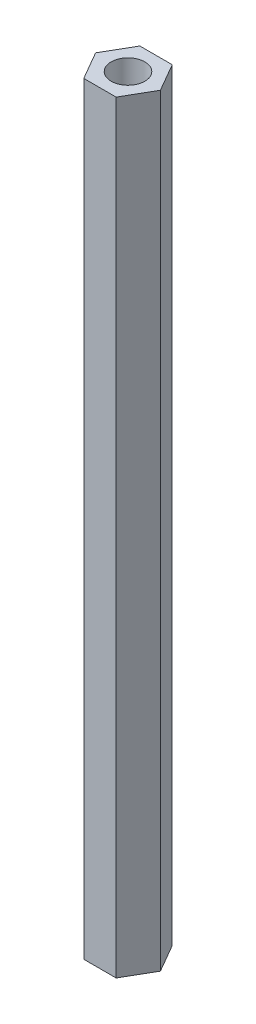
ISO-10303-21;
HEADER;
FILE_DESCRIPTION(('STEP AP214'),'2;1');
FILE_NAME('part.step','',(''),(''),'','','');
FILE_SCHEMA(('AUTOMOTIVE_DESIGN { 1 0 10303 214 1 1 1 1 }'));
ENDSEC;
DATA;
#1=APPLICATION_CONTEXT('core data for automotive mechanical design processes');
#2=APPLICATION_PROTOCOL_DEFINITION('international standard','automotive_design',2000,#1);
#3=PRODUCT_CONTEXT('',#1,'mechanical');
#4=PRODUCT('Part','Part','',(#3));
#5=PRODUCT_RELATED_PRODUCT_CATEGORY('part','',(#4));
#6=PRODUCT_DEFINITION_FORMATION('','',#4);
#7=PRODUCT_DEFINITION_CONTEXT('part definition',#1,'design');
#8=PRODUCT_DEFINITION('design','',#6,#7);
#9=PRODUCT_DEFINITION_SHAPE('','',#8);
#10=(LENGTH_UNIT() NAMED_UNIT(*) SI_UNIT(.MILLI.,.METRE.));
#11=(NAMED_UNIT(*) PLANE_ANGLE_UNIT() SI_UNIT($,.RADIAN.));
#12=(NAMED_UNIT(*) SI_UNIT($,.STERADIAN.) SOLID_ANGLE_UNIT());
#13=UNCERTAINTY_MEASURE_WITH_UNIT(LENGTH_MEASURE(1.E-05),#10,'distance_accuracy_value','');
#14=(GEOMETRIC_REPRESENTATION_CONTEXT(3) GLOBAL_UNCERTAINTY_ASSIGNED_CONTEXT((#13)) GLOBAL_UNIT_ASSIGNED_CONTEXT((#10,
#11,#12)) REPRESENTATION_CONTEXT('',''));
#15=CARTESIAN_POINT('',(0.,0.,0.));
#16=DIRECTION('',(0.,0.,1.));
#17=DIRECTION('',(1.,0.,0.));
#18=AXIS2_PLACEMENT_3D('',#15,#16,#17);
#19=CARTESIAN_POINT('',(1.44337567297407,68.,2.5));
#20=DIRECTION('',(-0.866025403784439,0.,-0.5));
#21=DIRECTION('',(-0.5,0.,0.866025403784439));
#22=AXIS2_PLACEMENT_3D('',#19,#20,#21);
#23=PLANE('',#22);
#24=DIRECTION('',(0.5,0.,-0.866025403784439));
#25=VECTOR('',#24,1.);
#26=CARTESIAN_POINT('',(1.44337567297407,0.,2.5));
#27=LINE('',#26,#25);
#28=CARTESIAN_POINT('',(1.44337567297407,0.,2.5));
#29=VERTEX_POINT('',#28);
#30=CARTESIAN_POINT('',(2.88675134594813,0.,0.));
#31=VERTEX_POINT('',#30);
#32=EDGE_CURVE('E117',#29,#31,#27,.T.);
#33=ORIENTED_EDGE('',*,*,#32,.T.);
#34=DIRECTION('',(0.,-1.,0.));
#35=VECTOR('',#34,1.);
#36=CARTESIAN_POINT('',(2.88675134594813,68.,0.));
#37=LINE('',#36,#35);
#38=CARTESIAN_POINT('',(2.88675134594813,68.,0.));
#39=VERTEX_POINT('',#38);
#40=EDGE_CURVE('E11',#39,#31,#37,.T.);
#41=ORIENTED_EDGE('',*,*,#40,.F.);
#42=DIRECTION('',(0.5,0.,-0.866025403784439));
#43=VECTOR('',#42,1.);
#44=CARTESIAN_POINT('',(1.44337567297407,68.,2.5));
#45=LINE('',#44,#43);
#46=CARTESIAN_POINT('',(1.44337567297407,68.,2.5));
#47=VERTEX_POINT('',#46);
#48=EDGE_CURVE('E128',#47,#39,#45,.T.);
#49=ORIENTED_EDGE('',*,*,#48,.F.);
#50=DIRECTION('',(0.,-1.,0.));
#51=VECTOR('',#50,1.);
#52=CARTESIAN_POINT('',(1.44337567297407,68.,2.5));
#53=LINE('',#52,#51);
#54=EDGE_CURVE('E113',#47,#29,#53,.T.);
#55=ORIENTED_EDGE('',*,*,#54,.T.);
#56=EDGE_LOOP('',(#33,#41,#49,#55));
#57=FACE_BOUND('',#56,.T.);
#58=ADVANCED_FACE('F33',(#57),#23,.F.);
#59=CARTESIAN_POINT('',(2.88675134594813,68.,0.));
#60=DIRECTION('',(-0.866025403784439,0.,0.5));
#61=DIRECTION('',(0.5,0.,0.866025403784439));
#62=AXIS2_PLACEMENT_3D('',#59,#60,#61);
#63=PLANE('',#62);
#64=DIRECTION('',(-0.5,0.,-0.866025403784439));
#65=VECTOR('',#64,1.);
#66=CARTESIAN_POINT('',(2.88675134594813,0.,0.));
#67=LINE('',#66,#65);
#68=CARTESIAN_POINT('',(1.44337567297406,0.,-2.5));
#69=VERTEX_POINT('',#68);
#70=EDGE_CURVE('E120',#31,#69,#67,.T.);
#71=ORIENTED_EDGE('',*,*,#70,.T.);
#72=DIRECTION('',(0.,-1.,0.));
#73=VECTOR('',#72,1.);
#74=CARTESIAN_POINT('',(1.44337567297406,68.,-2.5));
#75=LINE('',#74,#73);
#76=CARTESIAN_POINT('',(1.44337567297406,68.,-2.5));
#77=VERTEX_POINT('',#76);
#78=EDGE_CURVE('E41',#77,#69,#75,.T.);
#79=ORIENTED_EDGE('',*,*,#78,.F.);
#80=DIRECTION('',(-0.5,0.,-0.866025403784439));
#81=VECTOR('',#80,1.);
#82=CARTESIAN_POINT('',(2.88675134594813,68.,0.));
#83=LINE('',#82,#81);
#84=EDGE_CURVE('E86',#39,#77,#83,.T.);
#85=ORIENTED_EDGE('',*,*,#84,.F.);
#86=ORIENTED_EDGE('',*,*,#40,.T.);
#87=EDGE_LOOP('',(#71,#79,#85,#86));
#88=FACE_BOUND('',#87,.T.);
#89=ADVANCED_FACE('F153',(#88),#63,.F.);
#90=CARTESIAN_POINT('',(1.44337567297406,68.,-2.5));
#91=DIRECTION('',(0.,0.,1.));
#92=DIRECTION('',(1.,0.,0.));
#93=AXIS2_PLACEMENT_3D('',#90,#91,#92);
#94=PLANE('',#93);
#95=DIRECTION('',(-1.,0.,0.));
#96=VECTOR('',#95,1.);
#97=CARTESIAN_POINT('',(1.44337567297406,0.,-2.5));
#98=LINE('',#97,#96);
#99=CARTESIAN_POINT('',(-1.44337567297407,0.,-2.5));
#100=VERTEX_POINT('',#99);
#101=EDGE_CURVE('E123',#69,#100,#98,.T.);
#102=ORIENTED_EDGE('',*,*,#101,.T.);
#103=DIRECTION('',(0.,-1.,0.));
#104=VECTOR('',#103,1.);
#105=CARTESIAN_POINT('',(-1.44337567297407,68.,-2.5));
#106=LINE('',#105,#104);
#107=CARTESIAN_POINT('',(-1.44337567297407,68.,-2.5));
#108=VERTEX_POINT('',#107);
#109=EDGE_CURVE('E108',#108,#100,#106,.T.);
#110=ORIENTED_EDGE('',*,*,#109,.F.);
#111=DIRECTION('',(-1.,0.,0.));
#112=VECTOR('',#111,1.);
#113=CARTESIAN_POINT('',(1.44337567297406,68.,-2.5));
#114=LINE('',#113,#112);
#115=EDGE_CURVE('E99',#77,#108,#114,.T.);
#116=ORIENTED_EDGE('',*,*,#115,.F.);
#117=ORIENTED_EDGE('',*,*,#78,.T.);
#118=EDGE_LOOP('',(#102,#110,#116,#117));
#119=FACE_BOUND('',#118,.T.);
#120=ADVANCED_FACE('F134',(#119),#94,.F.);
#121=CARTESIAN_POINT('',(-1.44337567297407,68.,-2.5));
#122=DIRECTION('',(0.866025403784439,0.,0.5));
#123=DIRECTION('',(0.5,0.,-0.866025403784439));
#124=AXIS2_PLACEMENT_3D('',#121,#122,#123);
#125=PLANE('',#124);
#126=DIRECTION('',(-0.5,0.,0.866025403784439));
#127=VECTOR('',#126,1.);
#128=CARTESIAN_POINT('',(-1.44337567297407,0.,-2.5));
#129=LINE('',#128,#127);
#130=CARTESIAN_POINT('',(-2.88675134594813,0.,0.));
#131=VERTEX_POINT('',#130);
#132=EDGE_CURVE('E107',#100,#131,#129,.T.);
#133=ORIENTED_EDGE('',*,*,#132,.T.);
#134=DIRECTION('',(0.,-1.,0.));
#135=VECTOR('',#134,1.);
#136=CARTESIAN_POINT('',(-2.88675134594813,68.,0.));
#137=LINE('',#136,#135);
#138=CARTESIAN_POINT('',(-2.88675134594813,68.,0.));
#139=VERTEX_POINT('',#138);
#140=EDGE_CURVE('E104',#139,#131,#137,.T.);
#141=ORIENTED_EDGE('',*,*,#140,.F.);
#142=DIRECTION('',(-0.5,0.,0.866025403784439));
#143=VECTOR('',#142,1.);
#144=CARTESIAN_POINT('',(-1.44337567297407,68.,-2.5));
#145=LINE('',#144,#143);
#146=EDGE_CURVE('E93',#108,#139,#145,.T.);
#147=ORIENTED_EDGE('',*,*,#146,.F.);
#148=ORIENTED_EDGE('',*,*,#109,.T.);
#149=EDGE_LOOP('',(#133,#141,#147,#148));
#150=FACE_BOUND('',#149,.T.);
#151=ADVANCED_FACE('F105',(#150),#125,.F.);
#152=CARTESIAN_POINT('',(-2.88675134594813,68.,0.));
#153=DIRECTION('',(0.866025403784439,0.,-0.5));
#154=DIRECTION('',(-0.5,0.,-0.866025403784439));
#155=AXIS2_PLACEMENT_3D('',#152,#153,#154);
#156=PLANE('',#155);
#157=DIRECTION('',(0.5,0.,0.866025403784439));
#158=VECTOR('',#157,1.);
#159=CARTESIAN_POINT('',(-2.88675134594813,0.,0.));
#160=LINE('',#159,#158);
#161=CARTESIAN_POINT('',(-1.44337567297406,0.,2.5));
#162=VERTEX_POINT('',#161);
#163=EDGE_CURVE('E72',#131,#162,#160,.T.);
#164=ORIENTED_EDGE('',*,*,#163,.T.);
#165=DIRECTION('',(0.,-1.,0.));
#166=VECTOR('',#165,1.);
#167=CARTESIAN_POINT('',(-1.44337567297406,68.,2.5));
#168=LINE('',#167,#166);
#169=CARTESIAN_POINT('',(-1.44337567297406,68.,2.5));
#170=VERTEX_POINT('',#169);
#171=EDGE_CURVE('E109',#170,#162,#168,.T.);
#172=ORIENTED_EDGE('',*,*,#171,.F.);
#173=DIRECTION('',(0.5,0.,0.866025403784439));
#174=VECTOR('',#173,1.);
#175=CARTESIAN_POINT('',(-2.88675134594813,68.,0.));
#176=LINE('',#175,#174);
#177=EDGE_CURVE('E97',#139,#170,#176,.T.);
#178=ORIENTED_EDGE('',*,*,#177,.F.);
#179=ORIENTED_EDGE('',*,*,#140,.T.);
#180=EDGE_LOOP('',(#164,#172,#178,#179));
#181=FACE_BOUND('',#180,.T.);
#182=ADVANCED_FACE('F111',(#181),#156,.F.);
#183=CARTESIAN_POINT('',(-1.44337567297406,68.,2.5));
#184=DIRECTION('',(0.,0.,-1.));
#185=DIRECTION('',(-1.,0.,0.));
#186=AXIS2_PLACEMENT_3D('',#183,#184,#185);
#187=PLANE('',#186);
#188=DIRECTION('',(1.,0.,0.));
#189=VECTOR('',#188,1.);
#190=CARTESIAN_POINT('',(-1.44337567297406,0.,2.5));
#191=LINE('',#190,#189);
#192=EDGE_CURVE('E78',#162,#29,#191,.T.);
#193=ORIENTED_EDGE('',*,*,#192,.T.);
#194=ORIENTED_EDGE('',*,*,#54,.F.);
#195=DIRECTION('',(1.,0.,0.));
#196=VECTOR('',#195,1.);
#197=CARTESIAN_POINT('',(-1.44337567297406,68.,2.5));
#198=LINE('',#197,#196);
#199=EDGE_CURVE('E49',#170,#47,#198,.T.);
#200=ORIENTED_EDGE('',*,*,#199,.F.);
#201=ORIENTED_EDGE('',*,*,#171,.T.);
#202=EDGE_LOOP('',(#193,#194,#200,#201));
#203=FACE_BOUND('',#202,.T.);
#204=ADVANCED_FACE('F141',(#203),#187,.F.);
#205=CARTESIAN_POINT('',(0.,68.,0.));
#206=DIRECTION('',(0.,1.,0.));
#207=DIRECTION('',(0.,0.,1.));
#208=AXIS2_PLACEMENT_3D('',#205,#206,#207);
#209=PLANE('',#208);
#210=CARTESIAN_POINT('',(0.,68.,0.));
#211=DIRECTION('',(0.,1.,0.));
#212=DIRECTION('',(0.,0.,1.));
#213=AXIS2_PLACEMENT_3D('',#210,#211,#212);
#214=CIRCLE('',#213,1.5);
#215=CARTESIAN_POINT('',(0.,68.,1.5));
#216=VERTEX_POINT('',#215);
#217=EDGE_CURVE('E208',#216,#216,#214,.T.);
#218=ORIENTED_EDGE('',*,*,#217,.F.);
#219=EDGE_LOOP('',(#218));
#220=FACE_BOUND('',#219,.T.);
#221=ORIENTED_EDGE('',*,*,#48,.T.);
#222=ORIENTED_EDGE('',*,*,#84,.T.);
#223=ORIENTED_EDGE('',*,*,#115,.T.);
#224=ORIENTED_EDGE('',*,*,#146,.T.);
#225=ORIENTED_EDGE('',*,*,#177,.T.);
#226=ORIENTED_EDGE('',*,*,#199,.T.);
#227=EDGE_LOOP('',(#221,#222,#223,#224,#225,#226));
#228=FACE_BOUND('',#227,.T.);
#229=ADVANCED_FACE('F95',(#220,#228),#209,.T.);
#230=CARTESIAN_POINT('',(0.,0.,0.));
#231=DIRECTION('',(0.,1.,0.));
#232=DIRECTION('',(0.,0.,1.));
#233=AXIS2_PLACEMENT_3D('',#230,#231,#232);
#234=PLANE('',#233);
#235=CARTESIAN_POINT('',(0.,0.,0.));
#236=DIRECTION('',(0.,1.,0.));
#237=DIRECTION('',(0.,0.,1.));
#238=AXIS2_PLACEMENT_3D('',#235,#236,#237);
#239=CIRCLE('',#238,1.5);
#240=CARTESIAN_POINT('',(0.,0.,1.5));
#241=VERTEX_POINT('',#240);
#242=EDGE_CURVE('E121',#241,#241,#239,.T.);
#243=ORIENTED_EDGE('',*,*,#242,.T.);
#244=EDGE_LOOP('',(#243));
#245=FACE_BOUND('',#244,.T.);
#246=ORIENTED_EDGE('',*,*,#32,.F.);
#247=ORIENTED_EDGE('',*,*,#192,.F.);
#248=ORIENTED_EDGE('',*,*,#163,.F.);
#249=ORIENTED_EDGE('',*,*,#132,.F.);
#250=ORIENTED_EDGE('',*,*,#101,.F.);
#251=ORIENTED_EDGE('',*,*,#70,.F.);
#252=EDGE_LOOP('',(#246,#247,#248,#249,#250,#251));
#253=FACE_BOUND('',#252,.T.);
#254=ADVANCED_FACE('F137',(#245,#253),#234,.F.);
#255=CARTESIAN_POINT('',(0.,0.,0.));
#256=DIRECTION('',(0.,1.,0.));
#257=DIRECTION('',(0.,0.,1.));
#258=AXIS2_PLACEMENT_3D('',#255,#256,#257);
#259=CYLINDRICAL_SURFACE('',#258,1.5);
#260=ORIENTED_EDGE('',*,*,#242,.F.);
#261=EDGE_LOOP('',(#260));
#262=FACE_BOUND('',#261,.T.);
#263=ORIENTED_EDGE('',*,*,#217,.T.);
#264=EDGE_LOOP('',(#263));
#265=FACE_BOUND('',#264,.T.);
#266=ADVANCED_FACE('F190',(#262,#265),#259,.F.);
#267=CLOSED_SHELL('',(#58,#89,#120,#151,#182,#204,#229,#254,#266));
#268=MANIFOLD_SOLID_BREP('B2',#267);
#269=ADVANCED_BREP_SHAPE_REPRESENTATION('',(#18,#268),#14);
#270=SHAPE_DEFINITION_REPRESENTATION(#9,#269);
ENDSEC;
END-ISO-10303-21;
